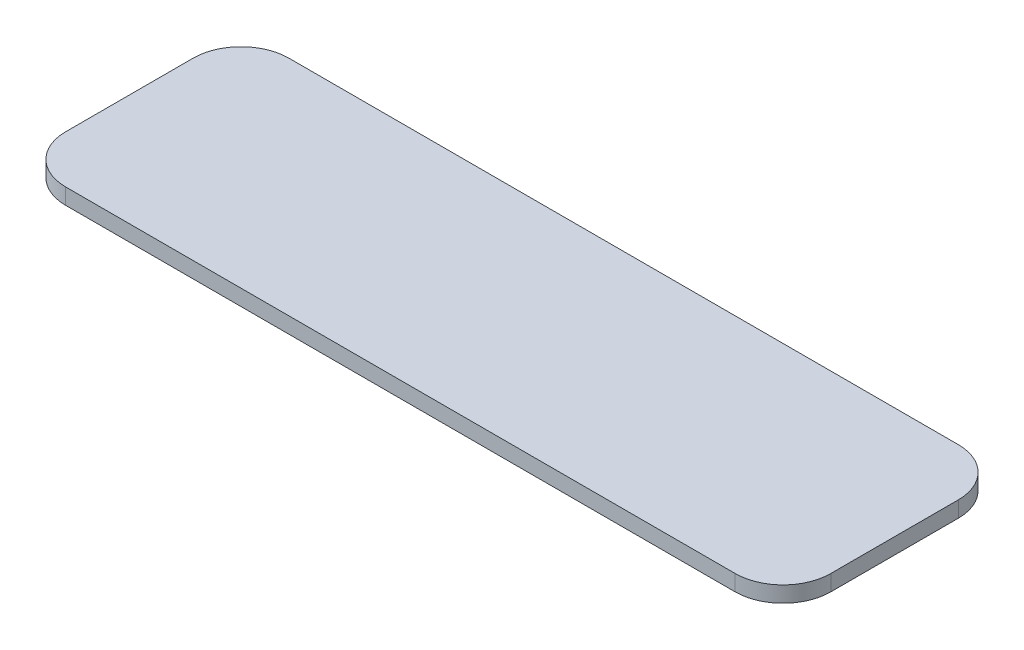
ISO-10303-21;
HEADER;
FILE_DESCRIPTION(('STEP AP214'),'2;1');
FILE_NAME('part.step','',(''),(''),'','','');
FILE_SCHEMA(('AUTOMOTIVE_DESIGN { 1 0 10303 214 1 1 1 1 }'));
ENDSEC;
DATA;
#1=APPLICATION_CONTEXT('core data for automotive mechanical design processes');
#2=APPLICATION_PROTOCOL_DEFINITION('international standard','automotive_design',2000,#1);
#3=PRODUCT_CONTEXT('',#1,'mechanical');
#4=PRODUCT('Part','Part','',(#3));
#5=PRODUCT_RELATED_PRODUCT_CATEGORY('part','',(#4));
#6=PRODUCT_DEFINITION_FORMATION('','',#4);
#7=PRODUCT_DEFINITION_CONTEXT('part definition',#1,'design');
#8=PRODUCT_DEFINITION('design','',#6,#7);
#9=PRODUCT_DEFINITION_SHAPE('','',#8);
#10=(LENGTH_UNIT() NAMED_UNIT(*) SI_UNIT(.MILLI.,.METRE.));
#11=(NAMED_UNIT(*) PLANE_ANGLE_UNIT() SI_UNIT($,.RADIAN.));
#12=(NAMED_UNIT(*) SI_UNIT($,.STERADIAN.) SOLID_ANGLE_UNIT());
#13=UNCERTAINTY_MEASURE_WITH_UNIT(LENGTH_MEASURE(1.E-05),#10,'distance_accuracy_value','');
#14=(GEOMETRIC_REPRESENTATION_CONTEXT(3) GLOBAL_UNCERTAINTY_ASSIGNED_CONTEXT((#13)) GLOBAL_UNIT_ASSIGNED_CONTEXT((#10,
#11,#12)) REPRESENTATION_CONTEXT('',''));
#15=CARTESIAN_POINT('',(0.,0.,0.));
#16=DIRECTION('',(0.,0.,1.));
#17=DIRECTION('',(1.,0.,0.));
#18=AXIS2_PLACEMENT_3D('',#15,#16,#17);
#19=CARTESIAN_POINT('',(31.5,1.5,-6.));
#20=DIRECTION('',(0.,-1.,0.));
#21=DIRECTION('',(0.,0.,-1.));
#22=AXIS2_PLACEMENT_3D('',#19,#20,#21);
#23=CYLINDRICAL_SURFACE('',#22,4.5);
#24=CARTESIAN_POINT('',(31.5,0.,-6.));
#25=DIRECTION('',(0.,1.,0.));
#26=DIRECTION('',(0.,0.,-1.));
#27=AXIS2_PLACEMENT_3D('',#24,#25,#26);
#28=CIRCLE('',#27,4.5);
#29=CARTESIAN_POINT('',(36.,0.,-5.99999999999997));
#30=VERTEX_POINT('',#29);
#31=CARTESIAN_POINT('',(31.5,0.,-10.5));
#32=VERTEX_POINT('',#31);
#33=EDGE_CURVE('E135',#30,#32,#28,.T.);
#34=ORIENTED_EDGE('',*,*,#33,.T.);
#35=DIRECTION('',(0.,-1.,0.));
#36=VECTOR('',#35,1.);
#37=CARTESIAN_POINT('',(31.5,1.5,-10.5));
#38=LINE('',#37,#36);
#39=CARTESIAN_POINT('',(31.5,1.5,-10.5));
#40=VERTEX_POINT('',#39);
#41=EDGE_CURVE('E11',#40,#32,#38,.T.);
#42=ORIENTED_EDGE('',*,*,#41,.F.);
#43=CARTESIAN_POINT('',(31.5,1.5,-6.));
#44=DIRECTION('',(0.,1.,0.));
#45=DIRECTION('',(0.,0.,-1.));
#46=AXIS2_PLACEMENT_3D('',#43,#44,#45);
#47=CIRCLE('',#46,4.5);
#48=CARTESIAN_POINT('',(36.,1.5,-5.99999999999997));
#49=VERTEX_POINT('',#48);
#50=EDGE_CURVE('E149',#49,#40,#47,.T.);
#51=ORIENTED_EDGE('',*,*,#50,.F.);
#52=DIRECTION('',(0.,-1.,0.));
#53=VECTOR('',#52,1.);
#54=CARTESIAN_POINT('',(36.,1.5,-5.99999999999997));
#55=LINE('',#54,#53);
#56=EDGE_CURVE('E131',#49,#30,#55,.T.);
#57=ORIENTED_EDGE('',*,*,#56,.T.);
#58=EDGE_LOOP('',(#34,#42,#51,#57));
#59=FACE_BOUND('',#58,.T.);
#60=ADVANCED_FACE('F39',(#59),#23,.T.);
#61=CARTESIAN_POINT('',(-31.5,1.5,-10.5));
#62=DIRECTION('',(0.,0.,1.));
#63=DIRECTION('',(1.,0.,0.));
#64=AXIS2_PLACEMENT_3D('',#61,#62,#63);
#65=PLANE('',#64);
#66=DIRECTION('',(-1.,0.,0.));
#67=VECTOR('',#66,1.);
#68=CARTESIAN_POINT('',(-31.5,0.,-10.5));
#69=LINE('',#68,#67);
#70=CARTESIAN_POINT('',(-31.5,0.,-10.5));
#71=VERTEX_POINT('',#70);
#72=EDGE_CURVE('E138',#32,#71,#69,.T.);
#73=ORIENTED_EDGE('',*,*,#72,.T.);
#74=DIRECTION('',(0.,-1.,0.));
#75=VECTOR('',#74,1.);
#76=CARTESIAN_POINT('',(-31.5,1.5,-10.5));
#77=LINE('',#76,#75);
#78=CARTESIAN_POINT('',(-31.5,1.5,-10.5));
#79=VERTEX_POINT('',#78);
#80=EDGE_CURVE('E47',#79,#71,#77,.T.);
#81=ORIENTED_EDGE('',*,*,#80,.F.);
#82=DIRECTION('',(-1.,0.,0.));
#83=VECTOR('',#82,1.);
#84=CARTESIAN_POINT('',(-31.5,1.5,-10.5));
#85=LINE('',#84,#83);
#86=EDGE_CURVE('E98',#40,#79,#85,.T.);
#87=ORIENTED_EDGE('',*,*,#86,.F.);
#88=ORIENTED_EDGE('',*,*,#41,.T.);
#89=EDGE_LOOP('',(#73,#81,#87,#88));
#90=FACE_BOUND('',#89,.T.);
#91=ADVANCED_FACE('F184',(#90),#65,.F.);
#92=CARTESIAN_POINT('',(-31.5,1.5,-6.));
#93=DIRECTION('',(0.,-1.,0.));
#94=DIRECTION('',(0.,0.,-1.));
#95=AXIS2_PLACEMENT_3D('',#92,#93,#94);
#96=CYLINDRICAL_SURFACE('',#95,4.5);
#97=CARTESIAN_POINT('',(-31.5,0.,-6.));
#98=DIRECTION('',(0.,1.,0.));
#99=DIRECTION('',(0.,0.,1.));
#100=AXIS2_PLACEMENT_3D('',#97,#98,#99);
#101=CIRCLE('',#100,4.5);
#102=CARTESIAN_POINT('',(-36.,0.,-5.99999999999997));
#103=VERTEX_POINT('',#102);
#104=EDGE_CURVE('E140',#71,#103,#101,.T.);
#105=ORIENTED_EDGE('',*,*,#104,.T.);
#106=DIRECTION('',(0.,-1.,0.));
#107=VECTOR('',#106,1.);
#108=CARTESIAN_POINT('',(-36.,1.5,-5.99999999999997));
#109=LINE('',#108,#107);
#110=CARTESIAN_POINT('',(-36.,1.5,-5.99999999999997));
#111=VERTEX_POINT('',#110);
#112=EDGE_CURVE('E156',#111,#103,#109,.T.);
#113=ORIENTED_EDGE('',*,*,#112,.F.);
#114=CARTESIAN_POINT('',(-31.5,1.5,-6.));
#115=DIRECTION('',(0.,1.,0.));
#116=DIRECTION('',(0.,0.,1.));
#117=AXIS2_PLACEMENT_3D('',#114,#115,#116);
#118=CIRCLE('',#117,4.5);
#119=EDGE_CURVE('E164',#79,#111,#118,.T.);
#120=ORIENTED_EDGE('',*,*,#119,.F.);
#121=ORIENTED_EDGE('',*,*,#80,.T.);
#122=EDGE_LOOP('',(#105,#113,#120,#121));
#123=FACE_BOUND('',#122,.T.);
#124=ADVANCED_FACE('F162',(#123),#96,.T.);
#125=CARTESIAN_POINT('',(-36.,1.5,-5.99999999999997));
#126=DIRECTION('',(1.,0.,0.));
#127=DIRECTION('',(0.,0.,-1.));
#128=AXIS2_PLACEMENT_3D('',#125,#126,#127);
#129=PLANE('',#128);
#130=DIRECTION('',(0.,0.,1.));
#131=VECTOR('',#130,1.);
#132=CARTESIAN_POINT('',(-36.,0.,-5.99999999999997));
#133=LINE('',#132,#131);
#134=CARTESIAN_POINT('',(-36.,0.,5.99999999999997));
#135=VERTEX_POINT('',#134);
#136=EDGE_CURVE('E142',#103,#135,#133,.T.);
#137=ORIENTED_EDGE('',*,*,#136,.T.);
#138=DIRECTION('',(0.,-1.,0.));
#139=VECTOR('',#138,1.);
#140=CARTESIAN_POINT('',(-36.,1.5,5.99999999999997));
#141=LINE('',#140,#139);
#142=CARTESIAN_POINT('',(-36.,1.5,5.99999999999997));
#143=VERTEX_POINT('',#142);
#144=EDGE_CURVE('E153',#143,#135,#141,.T.);
#145=ORIENTED_EDGE('',*,*,#144,.F.);
#146=DIRECTION('',(0.,0.,1.));
#147=VECTOR('',#146,1.);
#148=CARTESIAN_POINT('',(-36.,1.5,-5.99999999999997));
#149=LINE('',#148,#147);
#150=EDGE_CURVE('E176',#111,#143,#149,.T.);
#151=ORIENTED_EDGE('',*,*,#150,.F.);
#152=ORIENTED_EDGE('',*,*,#112,.T.);
#153=EDGE_LOOP('',(#137,#145,#151,#152));
#154=FACE_BOUND('',#153,.T.);
#155=ADVANCED_FACE('F172',(#154),#129,.F.);
#156=CARTESIAN_POINT('',(-31.5,1.5,6.));
#157=DIRECTION('',(0.,-1.,0.));
#158=DIRECTION('',(0.,0.,-1.));
#159=AXIS2_PLACEMENT_3D('',#156,#157,#158);
#160=CYLINDRICAL_SURFACE('',#159,4.5);
#161=CARTESIAN_POINT('',(-31.5,0.,6.));
#162=DIRECTION('',(0.,1.,0.));
#163=DIRECTION('',(0.,0.,1.));
#164=AXIS2_PLACEMENT_3D('',#161,#162,#163);
#165=CIRCLE('',#164,4.5);
#166=CARTESIAN_POINT('',(-31.5,0.,10.5));
#167=VERTEX_POINT('',#166);
#168=EDGE_CURVE('E144',#135,#167,#165,.T.);
#169=ORIENTED_EDGE('',*,*,#168,.T.);
#170=DIRECTION('',(0.,-1.,0.));
#171=VECTOR('',#170,1.);
#172=CARTESIAN_POINT('',(-31.5,1.5,10.5));
#173=LINE('',#172,#171);
#174=CARTESIAN_POINT('',(-31.5,1.5,10.5));
#175=VERTEX_POINT('',#174);
#176=EDGE_CURVE('E126',#175,#167,#173,.T.);
#177=ORIENTED_EDGE('',*,*,#176,.F.);
#178=CARTESIAN_POINT('',(-31.5,1.5,6.));
#179=DIRECTION('',(0.,1.,0.));
#180=DIRECTION('',(0.,0.,1.));
#181=AXIS2_PLACEMENT_3D('',#178,#179,#180);
#182=CIRCLE('',#181,4.5);
#183=EDGE_CURVE('E117',#143,#175,#182,.T.);
#184=ORIENTED_EDGE('',*,*,#183,.F.);
#185=ORIENTED_EDGE('',*,*,#144,.T.);
#186=EDGE_LOOP('',(#169,#177,#184,#185));
#187=FACE_BOUND('',#186,.T.);
#188=ADVANCED_FACE('F175',(#187),#160,.T.);
#189=CARTESIAN_POINT('',(-31.5,1.5,10.5));
#190=DIRECTION('',(0.,0.,-1.));
#191=DIRECTION('',(-1.,0.,0.));
#192=AXIS2_PLACEMENT_3D('',#189,#190,#191);
#193=PLANE('',#192);
#194=DIRECTION('',(1.,0.,0.));
#195=VECTOR('',#194,1.);
#196=CARTESIAN_POINT('',(-31.5,0.,10.5));
#197=LINE('',#196,#195);
#198=CARTESIAN_POINT('',(31.5,0.,10.5));
#199=VERTEX_POINT('',#198);
#200=EDGE_CURVE('E125',#167,#199,#197,.T.);
#201=ORIENTED_EDGE('',*,*,#200,.T.);
#202=DIRECTION('',(0.,-1.,0.));
#203=VECTOR('',#202,1.);
#204=CARTESIAN_POINT('',(31.5,1.5,10.5));
#205=LINE('',#204,#203);
#206=CARTESIAN_POINT('',(31.5,1.5,10.5));
#207=VERTEX_POINT('',#206);
#208=EDGE_CURVE('E122',#207,#199,#205,.T.);
#209=ORIENTED_EDGE('',*,*,#208,.F.);
#210=DIRECTION('',(1.,0.,0.));
#211=VECTOR('',#210,1.);
#212=CARTESIAN_POINT('',(-31.5,1.5,10.5));
#213=LINE('',#212,#211);
#214=EDGE_CURVE('E111',#175,#207,#213,.T.);
#215=ORIENTED_EDGE('',*,*,#214,.F.);
#216=ORIENTED_EDGE('',*,*,#176,.T.);
#217=EDGE_LOOP('',(#201,#209,#215,#216));
#218=FACE_BOUND('',#217,.T.);
#219=ADVANCED_FACE('F123',(#218),#193,.F.);
#220=CARTESIAN_POINT('',(31.5,1.5,6.));
#221=DIRECTION('',(0.,-1.,0.));
#222=DIRECTION('',(0.,0.,-1.));
#223=AXIS2_PLACEMENT_3D('',#220,#221,#222);
#224=CYLINDRICAL_SURFACE('',#223,4.5);
#225=CARTESIAN_POINT('',(31.5,0.,6.));
#226=DIRECTION('',(0.,1.,0.));
#227=DIRECTION('',(0.,0.,1.));
#228=AXIS2_PLACEMENT_3D('',#225,#226,#227);
#229=CIRCLE('',#228,4.5);
#230=CARTESIAN_POINT('',(36.,0.,5.99999999999997));
#231=VERTEX_POINT('',#230);
#232=EDGE_CURVE('E84',#199,#231,#229,.T.);
#233=ORIENTED_EDGE('',*,*,#232,.T.);
#234=DIRECTION('',(0.,-1.,0.));
#235=VECTOR('',#234,1.);
#236=CARTESIAN_POINT('',(36.,1.5,5.99999999999997));
#237=LINE('',#236,#235);
#238=CARTESIAN_POINT('',(36.,1.5,5.99999999999997));
#239=VERTEX_POINT('',#238);
#240=EDGE_CURVE('E127',#239,#231,#237,.T.);
#241=ORIENTED_EDGE('',*,*,#240,.F.);
#242=CARTESIAN_POINT('',(31.5,1.5,6.));
#243=DIRECTION('',(0.,1.,0.));
#244=DIRECTION('',(0.,0.,1.));
#245=AXIS2_PLACEMENT_3D('',#242,#243,#244);
#246=CIRCLE('',#245,4.5);
#247=EDGE_CURVE('E115',#207,#239,#246,.T.);
#248=ORIENTED_EDGE('',*,*,#247,.F.);
#249=ORIENTED_EDGE('',*,*,#208,.T.);
#250=EDGE_LOOP('',(#233,#241,#248,#249));
#251=FACE_BOUND('',#250,.T.);
#252=ADVANCED_FACE('F129',(#251),#224,.T.);
#253=CARTESIAN_POINT('',(36.,1.5,-5.99999999999997));
#254=DIRECTION('',(-1.,0.,0.));
#255=DIRECTION('',(0.,0.,1.));
#256=AXIS2_PLACEMENT_3D('',#253,#254,#255);
#257=PLANE('',#256);
#258=DIRECTION('',(0.,0.,-1.));
#259=VECTOR('',#258,1.);
#260=CARTESIAN_POINT('',(36.,0.,-5.99999999999997));
#261=LINE('',#260,#259);
#262=EDGE_CURVE('E90',#231,#30,#261,.T.);
#263=ORIENTED_EDGE('',*,*,#262,.T.);
#264=ORIENTED_EDGE('',*,*,#56,.F.);
#265=DIRECTION('',(0.,0.,-1.));
#266=VECTOR('',#265,1.);
#267=CARTESIAN_POINT('',(36.,1.5,-5.99999999999997));
#268=LINE('',#267,#266);
#269=EDGE_CURVE('E55',#239,#49,#268,.T.);
#270=ORIENTED_EDGE('',*,*,#269,.F.);
#271=ORIENTED_EDGE('',*,*,#240,.T.);
#272=EDGE_LOOP('',(#263,#264,#270,#271));
#273=FACE_BOUND('',#272,.T.);
#274=ADVANCED_FACE('F200',(#273),#257,.F.);
#275=CARTESIAN_POINT('',(31.5,1.5,-6.));
#276=DIRECTION('',(0.,-1.,0.));
#277=DIRECTION('',(0.,0.,-1.));
#278=AXIS2_PLACEMENT_3D('',#275,#276,#277);
#279=PLANE('',#278);
#280=ORIENTED_EDGE('',*,*,#50,.T.);
#281=ORIENTED_EDGE('',*,*,#86,.T.);
#282=ORIENTED_EDGE('',*,*,#119,.T.);
#283=ORIENTED_EDGE('',*,*,#150,.T.);
#284=ORIENTED_EDGE('',*,*,#183,.T.);
#285=ORIENTED_EDGE('',*,*,#214,.T.);
#286=ORIENTED_EDGE('',*,*,#247,.T.);
#287=ORIENTED_EDGE('',*,*,#269,.T.);
#288=EDGE_LOOP('',(#280,#281,#282,#283,#284,#285,#286,#287));
#289=FACE_BOUND('',#288,.T.);
#290=ADVANCED_FACE('F113',(#289),#279,.F.);
#291=CARTESIAN_POINT('',(31.5,0.,-6.));
#292=DIRECTION('',(0.,-1.,0.));
#293=DIRECTION('',(0.,0.,-1.));
#294=AXIS2_PLACEMENT_3D('',#291,#292,#293);
#295=PLANE('',#294);
#296=ORIENTED_EDGE('',*,*,#33,.F.);
#297=ORIENTED_EDGE('',*,*,#262,.F.);
#298=ORIENTED_EDGE('',*,*,#232,.F.);
#299=ORIENTED_EDGE('',*,*,#200,.F.);
#300=ORIENTED_EDGE('',*,*,#168,.F.);
#301=ORIENTED_EDGE('',*,*,#136,.F.);
#302=ORIENTED_EDGE('',*,*,#104,.F.);
#303=ORIENTED_EDGE('',*,*,#72,.F.);
#304=EDGE_LOOP('',(#296,#297,#298,#299,#300,#301,#302,#303));
#305=FACE_BOUND('',#304,.T.);
#306=ADVANCED_FACE('F168',(#305),#295,.T.);
#307=CLOSED_SHELL('',(#60,#91,#124,#155,#188,#219,#252,#274,#290,#306));
#308=MANIFOLD_SOLID_BREP('B2',#307);
#309=ADVANCED_BREP_SHAPE_REPRESENTATION('',(#18,#308),#14);
#310=SHAPE_DEFINITION_REPRESENTATION(#9,#309);
ENDSEC;
END-ISO-10303-21;
